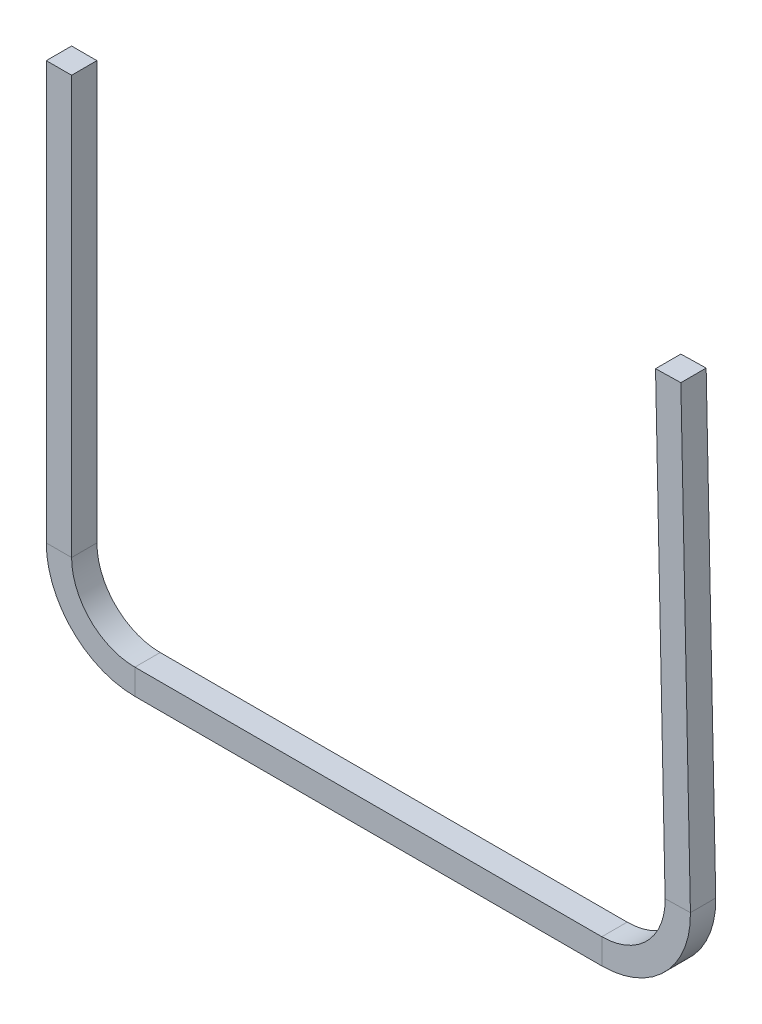
ISO-10303-21;
HEADER;
FILE_DESCRIPTION(('STEP AP214'),'2;1');
FILE_NAME('part.step','',(''),(''),'','','');
FILE_SCHEMA(('AUTOMOTIVE_DESIGN { 1 0 10303 214 1 1 1 1 }'));
ENDSEC;
DATA;
#1=APPLICATION_CONTEXT('core data for automotive mechanical design processes');
#2=APPLICATION_PROTOCOL_DEFINITION('international standard','automotive_design',2000,#1);
#3=PRODUCT_CONTEXT('',#1,'mechanical');
#4=PRODUCT('Part','Part','',(#3));
#5=PRODUCT_RELATED_PRODUCT_CATEGORY('part','',(#4));
#6=PRODUCT_DEFINITION_FORMATION('','',#4);
#7=PRODUCT_DEFINITION_CONTEXT('part definition',#1,'design');
#8=PRODUCT_DEFINITION('design','',#6,#7);
#9=PRODUCT_DEFINITION_SHAPE('','',#8);
#10=(LENGTH_UNIT() NAMED_UNIT(*) SI_UNIT(.MILLI.,.METRE.));
#11=(NAMED_UNIT(*) PLANE_ANGLE_UNIT() SI_UNIT($,.RADIAN.));
#12=(NAMED_UNIT(*) SI_UNIT($,.STERADIAN.) SOLID_ANGLE_UNIT());
#13=UNCERTAINTY_MEASURE_WITH_UNIT(LENGTH_MEASURE(1.E-05),#10,'distance_accuracy_value','');
#14=(GEOMETRIC_REPRESENTATION_CONTEXT(3) GLOBAL_UNCERTAINTY_ASSIGNED_CONTEXT((#13)) GLOBAL_UNIT_ASSIGNED_CONTEXT((#10,
#11,#12)) REPRESENTATION_CONTEXT('',''));
#15=CARTESIAN_POINT('',(0.,0.,0.));
#16=DIRECTION('',(0.,0.,1.));
#17=DIRECTION('',(1.,0.,0.));
#18=AXIS2_PLACEMENT_3D('',#15,#16,#17);
#19=CARTESIAN_POINT('',(25.,-190.,10.));
#20=DIRECTION('',(0.,0.,1.));
#21=DIRECTION('',(1.,0.,0.));
#22=AXIS2_PLACEMENT_3D('',#19,#20,#21);
#23=PLANE('',#22);
#24=DIRECTION('',(0.,-1.,0.));
#25=VECTOR('',#24,1.);
#26=CARTESIAN_POINT('',(25.,-190.,10.));
#27=LINE('',#26,#25);
#28=CARTESIAN_POINT('',(25.,-190.,10.));
#29=VERTEX_POINT('',#28);
#30=CARTESIAN_POINT('',(25.,-200.,10.));
#31=VERTEX_POINT('',#30);
#32=EDGE_CURVE('E11',#29,#31,#27,.T.);
#33=ORIENTED_EDGE('',*,*,#32,.F.);
#34=CARTESIAN_POINT('',(25.,-165.,10.));
#35=DIRECTION('',(0.,0.,-1.));
#36=DIRECTION('',(-1.,0.,0.));
#37=AXIS2_PLACEMENT_3D('',#34,#35,#36);
#38=CIRCLE('',#37,25.);
#39=CARTESIAN_POINT('',(0.,-165.,10.));
#40=VERTEX_POINT('',#39);
#41=EDGE_CURVE('E249',#40,#29,#38,.F.);
#42=ORIENTED_EDGE('',*,*,#41,.F.);
#43=DIRECTION('',(1.,0.,0.));
#44=VECTOR('',#43,1.);
#45=CARTESIAN_POINT('',(-10.,-165.,10.));
#46=LINE('',#45,#44);
#47=CARTESIAN_POINT('',(-10.,-165.,10.));
#48=VERTEX_POINT('',#47);
#49=EDGE_CURVE('E47',#48,#40,#46,.T.);
#50=ORIENTED_EDGE('',*,*,#49,.F.);
#51=CARTESIAN_POINT('',(25.,-165.,10.));
#52=DIRECTION('',(0.,0.,1.));
#53=DIRECTION('',(1.,0.,0.));
#54=AXIS2_PLACEMENT_3D('',#51,#52,#53);
#55=CIRCLE('',#54,35.);
#56=EDGE_CURVE('E148',#48,#31,#55,.T.);
#57=ORIENTED_EDGE('',*,*,#56,.T.);
#58=EDGE_LOOP('',(#33,#42,#50,#57));
#59=FACE_BOUND('',#58,.T.);
#60=ADVANCED_FACE('F39',(#59),#23,.T.);
#61=CARTESIAN_POINT('',(-10.,-165.,10.));
#62=DIRECTION('',(0.,0.,1.));
#63=DIRECTION('',(1.,0.,0.));
#64=AXIS2_PLACEMENT_3D('',#61,#62,#63);
#65=PLANE('',#64);
#66=DIRECTION('',(1.,0.,0.));
#67=VECTOR('',#66,1.);
#68=CARTESIAN_POINT('',(0.,-190.,10.));
#69=LINE('',#68,#67);
#70=CARTESIAN_POINT('',(209.468144658054,-190.,10.));
#71=VERTEX_POINT('',#70);
#72=EDGE_CURVE('E142',#29,#71,#69,.T.);
#73=ORIENTED_EDGE('',*,*,#72,.F.);
#74=ORIENTED_EDGE('',*,*,#32,.T.);
#75=DIRECTION('',(1.,0.,0.));
#76=VECTOR('',#75,1.);
#77=CARTESIAN_POINT('',(0.,-200.,10.));
#78=LINE('',#77,#76);
#79=CARTESIAN_POINT('',(209.468144658054,-200.,10.));
#80=VERTEX_POINT('',#79);
#81=EDGE_CURVE('E139',#31,#80,#78,.T.);
#82=ORIENTED_EDGE('',*,*,#81,.T.);
#83=DIRECTION('',(0.,1.,0.));
#84=VECTOR('',#83,1.);
#85=CARTESIAN_POINT('',(209.468144658054,-200.,10.));
#86=LINE('',#85,#84);
#87=EDGE_CURVE('E230',#80,#71,#86,.T.);
#88=ORIENTED_EDGE('',*,*,#87,.T.);
#89=EDGE_LOOP('',(#73,#74,#82,#88));
#90=FACE_BOUND('',#89,.T.);
#91=ADVANCED_FACE('F137',(#90),#65,.T.);
#92=CARTESIAN_POINT('',(0.,-165.,0.));
#93=DIRECTION('',(0.,0.,-1.));
#94=DIRECTION('',(-1.,0.,0.));
#95=AXIS2_PLACEMENT_3D('',#92,#93,#94);
#96=PLANE('',#95);
#97=DIRECTION('',(-1.,0.,0.));
#98=VECTOR('',#97,1.);
#99=CARTESIAN_POINT('',(0.,-165.,0.));
#100=LINE('',#99,#98);
#101=CARTESIAN_POINT('',(0.,-165.,0.));
#102=VERTEX_POINT('',#101);
#103=CARTESIAN_POINT('',(-10.,-165.,0.));
#104=VERTEX_POINT('',#103);
#105=EDGE_CURVE('E235',#102,#104,#100,.T.);
#106=ORIENTED_EDGE('',*,*,#105,.F.);
#107=CARTESIAN_POINT('',(25.,-165.,0.));
#108=DIRECTION('',(0.,0.,-1.));
#109=DIRECTION('',(-1.,0.,0.));
#110=AXIS2_PLACEMENT_3D('',#107,#108,#109);
#111=CIRCLE('',#110,25.);
#112=CARTESIAN_POINT('',(25.,-190.,0.));
#113=VERTEX_POINT('',#112);
#114=EDGE_CURVE('E187',#102,#113,#111,.F.);
#115=ORIENTED_EDGE('',*,*,#114,.T.);
#116=DIRECTION('',(0.,1.,0.));
#117=VECTOR('',#116,1.);
#118=CARTESIAN_POINT('',(25.,-200.,0.));
#119=LINE('',#118,#117);
#120=CARTESIAN_POINT('',(25.,-200.,0.));
#121=VERTEX_POINT('',#120);
#122=EDGE_CURVE('E233',#121,#113,#119,.T.);
#123=ORIENTED_EDGE('',*,*,#122,.F.);
#124=CARTESIAN_POINT('',(25.,-165.,0.));
#125=DIRECTION('',(0.,0.,1.));
#126=DIRECTION('',(1.,0.,0.));
#127=AXIS2_PLACEMENT_3D('',#124,#125,#126);
#128=CIRCLE('',#127,35.);
#129=EDGE_CURVE('E160',#104,#121,#128,.T.);
#130=ORIENTED_EDGE('',*,*,#129,.F.);
#131=EDGE_LOOP('',(#106,#115,#123,#130));
#132=FACE_BOUND('',#131,.T.);
#133=ADVANCED_FACE('F287',(#132),#96,.T.);
#134=CARTESIAN_POINT('',(25.,-200.,0.));
#135=DIRECTION('',(0.,0.,-1.));
#136=DIRECTION('',(-1.,0.,0.));
#137=AXIS2_PLACEMENT_3D('',#134,#135,#136);
#138=PLANE('',#137);
#139=DIRECTION('',(0.,-1.,0.));
#140=VECTOR('',#139,1.);
#141=CARTESIAN_POINT('',(0.,0.,0.));
#142=LINE('',#141,#140);
#143=CARTESIAN_POINT('',(0.,0.,0.));
#144=VERTEX_POINT('',#143);
#145=EDGE_CURVE('E190',#144,#102,#142,.T.);
#146=ORIENTED_EDGE('',*,*,#145,.T.);
#147=ORIENTED_EDGE('',*,*,#105,.T.);
#148=DIRECTION('',(0.,1.,0.));
#149=VECTOR('',#148,1.);
#150=CARTESIAN_POINT('',(-10.,0.,0.));
#151=LINE('',#150,#149);
#152=CARTESIAN_POINT('',(-10.,0.,0.));
#153=VERTEX_POINT('',#152);
#154=EDGE_CURVE('E196',#153,#104,#151,.F.);
#155=ORIENTED_EDGE('',*,*,#154,.F.);
#156=DIRECTION('',(1.,0.,0.));
#157=VECTOR('',#156,1.);
#158=CARTESIAN_POINT('',(-10.,0.,0.));
#159=LINE('',#158,#157);
#160=EDGE_CURVE('E193',#153,#144,#159,.T.);
#161=ORIENTED_EDGE('',*,*,#160,.T.);
#162=EDGE_LOOP('',(#146,#147,#155,#161));
#163=FACE_BOUND('',#162,.T.);
#164=ADVANCED_FACE('F290',(#163),#138,.T.);
#165=CARTESIAN_POINT('',(234.462606332776,-164.473800806848,10.));
#166=DIRECTION('',(0.,0.,1.));
#167=DIRECTION('',(1.,0.,0.));
#168=AXIS2_PLACEMENT_3D('',#165,#166,#167);
#169=PLANE('',#168);
#170=DIRECTION('',(0.999778466988863,0.0210479677260817,0.));
#171=VECTOR('',#170,1.);
#172=CARTESIAN_POINT('',(234.462606332776,-164.473800806848,10.));
#173=LINE('',#172,#171);
#174=CARTESIAN_POINT('',(234.462606332776,-164.473800806848,10.));
#175=VERTEX_POINT('',#174);
#176=CARTESIAN_POINT('',(244.460391002664,-164.263321129587,10.));
#177=VERTEX_POINT('',#176);
#178=EDGE_CURVE('E55',#175,#177,#173,.T.);
#179=ORIENTED_EDGE('',*,*,#178,.F.);
#180=CARTESIAN_POINT('',(209.468144658054,-165.,10.));
#181=DIRECTION('',(0.,0.,-1.));
#182=DIRECTION('',(-1.,0.,0.));
#183=AXIS2_PLACEMENT_3D('',#180,#181,#182);
#184=CIRCLE('',#183,25.);
#185=EDGE_CURVE('E259',#71,#175,#184,.F.);
#186=ORIENTED_EDGE('',*,*,#185,.F.);
#187=ORIENTED_EDGE('',*,*,#87,.F.);
#188=CARTESIAN_POINT('',(209.468144658054,-165.,10.));
#189=DIRECTION('',(0.,0.,1.));
#190=DIRECTION('',(1.,0.,0.));
#191=AXIS2_PLACEMENT_3D('',#188,#189,#190);
#192=CIRCLE('',#191,35.);
#193=EDGE_CURVE('E168',#80,#177,#192,.T.);
#194=ORIENTED_EDGE('',*,*,#193,.T.);
#195=EDGE_LOOP('',(#179,#186,#187,#194));
#196=FACE_BOUND('',#195,.T.);
#197=ADVANCED_FACE('F282',(#196),#169,.T.);
#198=CARTESIAN_POINT('',(209.468144658054,-200.,10.));
#199=DIRECTION('',(0.,0.,1.));
#200=DIRECTION('',(1.,0.,0.));
#201=AXIS2_PLACEMENT_3D('',#198,#199,#200);
#202=PLANE('',#201);
#203=DIRECTION('',(-0.021047967726081,0.999778466988863,0.));
#204=VECTOR('',#203,1.);
#205=CARTESIAN_POINT('',(235.,-190.,10.));
#206=LINE('',#205,#204);
#207=CARTESIAN_POINT('',(230.685166616153,14.954585732717,10.));
#208=VERTEX_POINT('',#207);
#209=EDGE_CURVE('E262',#175,#208,#206,.T.);
#210=ORIENTED_EDGE('',*,*,#209,.F.);
#211=ORIENTED_EDGE('',*,*,#178,.T.);
#212=DIRECTION('',(-0.021047967726081,0.999778466988864,0.));
#213=VECTOR('',#212,1.);
#214=CARTESIAN_POINT('',(244.997784669889,-189.789520322739,10.));
#215=LINE('',#214,#213);
#216=CARTESIAN_POINT('',(240.682951286042,15.1650654099779,10.));
#217=VERTEX_POINT('',#216);
#218=EDGE_CURVE('E109',#177,#217,#215,.T.);
#219=ORIENTED_EDGE('',*,*,#218,.T.);
#220=DIRECTION('',(0.999778466988863,0.0210479677260872,0.));
#221=VECTOR('',#220,1.);
#222=CARTESIAN_POINT('',(230.685166616153,14.954585732717,10.));
#223=LINE('',#222,#221);
#224=EDGE_CURVE('E265',#208,#217,#223,.T.);
#225=ORIENTED_EDGE('',*,*,#224,.F.);
#226=EDGE_LOOP('',(#210,#211,#219,#225));
#227=FACE_BOUND('',#226,.T.);
#228=ADVANCED_FACE('F271',(#227),#202,.T.);
#229=CARTESIAN_POINT('',(209.468144658054,-190.,0.));
#230=DIRECTION('',(0.,0.,-1.));
#231=DIRECTION('',(-1.,0.,0.));
#232=AXIS2_PLACEMENT_3D('',#229,#230,#231);
#233=PLANE('',#232);
#234=DIRECTION('',(0.,-1.,0.));
#235=VECTOR('',#234,1.);
#236=CARTESIAN_POINT('',(209.468144658054,-190.,0.));
#237=LINE('',#236,#235);
#238=CARTESIAN_POINT('',(209.468144658054,-190.,0.));
#239=VERTEX_POINT('',#238);
#240=CARTESIAN_POINT('',(209.468144658054,-200.,0.));
#241=VERTEX_POINT('',#240);
#242=EDGE_CURVE('E96',#239,#241,#237,.T.);
#243=ORIENTED_EDGE('',*,*,#242,.F.);
#244=CARTESIAN_POINT('',(209.468144658054,-165.,0.));
#245=DIRECTION('',(0.,0.,-1.));
#246=DIRECTION('',(-1.,0.,0.));
#247=AXIS2_PLACEMENT_3D('',#244,#245,#246);
#248=CIRCLE('',#247,25.);
#249=CARTESIAN_POINT('',(234.462606332776,-164.473800806848,0.));
#250=VERTEX_POINT('',#249);
#251=EDGE_CURVE('E183',#239,#250,#248,.F.);
#252=ORIENTED_EDGE('',*,*,#251,.T.);
#253=DIRECTION('',(-0.999778466988863,-0.0210479677260817,0.));
#254=VECTOR('',#253,1.);
#255=CARTESIAN_POINT('',(244.460391002664,-164.263321129587,0.));
#256=LINE('',#255,#254);
#257=CARTESIAN_POINT('',(244.460391002664,-164.263321129587,0.));
#258=VERTEX_POINT('',#257);
#259=EDGE_CURVE('E103',#258,#250,#256,.T.);
#260=ORIENTED_EDGE('',*,*,#259,.F.);
#261=CARTESIAN_POINT('',(209.468144658054,-165.,0.));
#262=DIRECTION('',(0.,0.,1.));
#263=DIRECTION('',(1.,0.,0.));
#264=AXIS2_PLACEMENT_3D('',#261,#262,#263);
#265=CIRCLE('',#264,35.);
#266=EDGE_CURVE('E202',#241,#258,#265,.T.);
#267=ORIENTED_EDGE('',*,*,#266,.F.);
#268=EDGE_LOOP('',(#243,#252,#260,#267));
#269=FACE_BOUND('',#268,.T.);
#270=ADVANCED_FACE('F319',(#269),#233,.T.);
#271=CARTESIAN_POINT('',(244.460391002664,-164.263321129587,0.));
#272=DIRECTION('',(0.,0.,-1.));
#273=DIRECTION('',(-1.,0.,0.));
#274=AXIS2_PLACEMENT_3D('',#271,#272,#273);
#275=PLANE('',#274);
#276=DIRECTION('',(1.,0.,0.));
#277=VECTOR('',#276,1.);
#278=CARTESIAN_POINT('',(0.,-190.,0.));
#279=LINE('',#278,#277);
#280=EDGE_CURVE('E185',#113,#239,#279,.T.);
#281=ORIENTED_EDGE('',*,*,#280,.T.);
#282=ORIENTED_EDGE('',*,*,#242,.T.);
#283=DIRECTION('',(1.,0.,0.));
#284=VECTOR('',#283,1.);
#285=CARTESIAN_POINT('',(0.,-200.,0.));
#286=LINE('',#285,#284);
#287=EDGE_CURVE('E200',#121,#241,#286,.T.);
#288=ORIENTED_EDGE('',*,*,#287,.F.);
#289=ORIENTED_EDGE('',*,*,#122,.T.);
#290=EDGE_LOOP('',(#281,#282,#288,#289));
#291=FACE_BOUND('',#290,.T.);
#292=ADVANCED_FACE('F322',(#291),#275,.T.);
#293=CARTESIAN_POINT('',(244.997784669889,-189.789520322739,10.));
#294=DIRECTION('',(-0.999778466988864,-0.021047967726081,0.));
#295=DIRECTION('',(0.021047967726081,-0.999778466988864,0.));
#296=AXIS2_PLACEMENT_3D('',#293,#294,#295);
#297=PLANE('',#296);
#298=DIRECTION('',(-0.021047967726081,0.999778466988864,0.));
#299=VECTOR('',#298,1.);
#300=CARTESIAN_POINT('',(244.997784669889,-189.789520322739,0.));
#301=LINE('',#300,#299);
#302=CARTESIAN_POINT('',(240.682951286042,15.1650654099779,0.));
#303=VERTEX_POINT('',#302);
#304=EDGE_CURVE('E174',#258,#303,#301,.T.);
#305=ORIENTED_EDGE('',*,*,#304,.T.);
#306=DIRECTION('',(0.,0.,-1.));
#307=VECTOR('',#306,1.);
#308=CARTESIAN_POINT('',(240.682951286042,15.1650654099779,10.));
#309=LINE('',#308,#307);
#310=EDGE_CURVE('E226',#217,#303,#309,.T.);
#311=ORIENTED_EDGE('',*,*,#310,.F.);
#312=ORIENTED_EDGE('',*,*,#218,.F.);
#313=DIRECTION('',(0.,0.,-1.));
#314=VECTOR('',#313,1.);
#315=CARTESIAN_POINT('',(244.460391002664,-164.263321129587,10.));
#316=LINE('',#315,#314);
#317=EDGE_CURVE('E170',#177,#258,#316,.T.);
#318=ORIENTED_EDGE('',*,*,#317,.T.);
#319=EDGE_LOOP('',(#305,#311,#312,#318));
#320=FACE_BOUND('',#319,.T.);
#321=ADVANCED_FACE('F325',(#320),#297,.F.);
#322=CARTESIAN_POINT('',(230.685166616153,14.954585732717,10.));
#323=DIRECTION('',(-0.0210479677260872,0.999778466988863,0.));
#324=DIRECTION('',(-0.999778466988863,-0.0210479677260872,0.));
#325=AXIS2_PLACEMENT_3D('',#322,#323,#324);
#326=PLANE('',#325);
#327=DIRECTION('',(0.999778466988863,0.0210479677260872,0.));
#328=VECTOR('',#327,1.);
#329=CARTESIAN_POINT('',(230.685166616153,14.954585732717,0.));
#330=LINE('',#329,#328);
#331=CARTESIAN_POINT('',(230.685166616153,14.954585732717,0.));
#332=VERTEX_POINT('',#331);
#333=EDGE_CURVE('E177',#332,#303,#330,.T.);
#334=ORIENTED_EDGE('',*,*,#333,.F.);
#335=DIRECTION('',(0.,0.,-1.));
#336=VECTOR('',#335,1.);
#337=CARTESIAN_POINT('',(230.685166616153,14.954585732717,10.));
#338=LINE('',#337,#336);
#339=EDGE_CURVE('E224',#208,#332,#338,.T.);
#340=ORIENTED_EDGE('',*,*,#339,.F.);
#341=ORIENTED_EDGE('',*,*,#224,.T.);
#342=ORIENTED_EDGE('',*,*,#310,.T.);
#343=EDGE_LOOP('',(#334,#340,#341,#342));
#344=FACE_BOUND('',#343,.T.);
#345=ADVANCED_FACE('F270',(#344),#326,.T.);
#346=CARTESIAN_POINT('',(235.,-190.,10.));
#347=DIRECTION('',(-0.999778466988864,-0.021047967726081,0.));
#348=DIRECTION('',(0.021047967726081,-0.999778466988864,0.));
#349=AXIS2_PLACEMENT_3D('',#346,#347,#348);
#350=PLANE('',#349);
#351=DIRECTION('',(-0.021047967726081,0.999778466988863,0.));
#352=VECTOR('',#351,1.);
#353=CARTESIAN_POINT('',(235.,-190.,0.));
#354=LINE('',#353,#352);
#355=EDGE_CURVE('E180',#250,#332,#354,.T.);
#356=ORIENTED_EDGE('',*,*,#355,.F.);
#357=DIRECTION('',(0.,0.,-1.));
#358=VECTOR('',#357,1.);
#359=CARTESIAN_POINT('',(234.462606332776,-164.473800806848,10.));
#360=LINE('',#359,#358);
#361=EDGE_CURVE('E221',#175,#250,#360,.T.);
#362=ORIENTED_EDGE('',*,*,#361,.F.);
#363=ORIENTED_EDGE('',*,*,#209,.T.);
#364=ORIENTED_EDGE('',*,*,#339,.T.);
#365=EDGE_LOOP('',(#356,#362,#363,#364));
#366=FACE_BOUND('',#365,.T.);
#367=ADVANCED_FACE('F275',(#366),#350,.T.);
#368=CARTESIAN_POINT('',(209.468144658054,-165.,10.));
#369=DIRECTION('',(0.,0.,-1.));
#370=DIRECTION('',(-1.,0.,0.));
#371=AXIS2_PLACEMENT_3D('',#368,#369,#370);
#372=CYLINDRICAL_SURFACE('',#371,25.);
#373=ORIENTED_EDGE('',*,*,#251,.F.);
#374=DIRECTION('',(0.,0.,-1.));
#375=VECTOR('',#374,1.);
#376=CARTESIAN_POINT('',(209.468144658054,-190.,10.));
#377=LINE('',#376,#375);
#378=EDGE_CURVE('E218',#71,#239,#377,.T.);
#379=ORIENTED_EDGE('',*,*,#378,.F.);
#380=ORIENTED_EDGE('',*,*,#185,.T.);
#381=ORIENTED_EDGE('',*,*,#361,.T.);
#382=EDGE_LOOP('',(#373,#379,#380,#381));
#383=FACE_BOUND('',#382,.T.);
#384=ADVANCED_FACE('F278',(#383),#372,.F.);
#385=CARTESIAN_POINT('',(0.,-190.,10.));
#386=DIRECTION('',(0.,1.,0.));
#387=DIRECTION('',(0.,0.,1.));
#388=AXIS2_PLACEMENT_3D('',#385,#386,#387);
#389=PLANE('',#388);
#390=ORIENTED_EDGE('',*,*,#280,.F.);
#391=DIRECTION('',(0.,0.,-1.));
#392=VECTOR('',#391,1.);
#393=CARTESIAN_POINT('',(25.,-190.,10.));
#394=LINE('',#393,#392);
#395=EDGE_CURVE('E215',#29,#113,#394,.T.);
#396=ORIENTED_EDGE('',*,*,#395,.F.);
#397=ORIENTED_EDGE('',*,*,#72,.T.);
#398=ORIENTED_EDGE('',*,*,#378,.T.);
#399=EDGE_LOOP('',(#390,#396,#397,#398));
#400=FACE_BOUND('',#399,.T.);
#401=ADVANCED_FACE('F285',(#400),#389,.T.);
#402=CARTESIAN_POINT('',(25.,-165.,10.));
#403=DIRECTION('',(0.,0.,-1.));
#404=DIRECTION('',(-1.,0.,0.));
#405=AXIS2_PLACEMENT_3D('',#402,#403,#404);
#406=CYLINDRICAL_SURFACE('',#405,25.);
#407=ORIENTED_EDGE('',*,*,#114,.F.);
#408=DIRECTION('',(0.,0.,-1.));
#409=VECTOR('',#408,1.);
#410=CARTESIAN_POINT('',(0.,-165.,10.));
#411=LINE('',#410,#409);
#412=EDGE_CURVE('E212',#40,#102,#411,.T.);
#413=ORIENTED_EDGE('',*,*,#412,.F.);
#414=ORIENTED_EDGE('',*,*,#41,.T.);
#415=ORIENTED_EDGE('',*,*,#395,.T.);
#416=EDGE_LOOP('',(#407,#413,#414,#415));
#417=FACE_BOUND('',#416,.T.);
#418=ADVANCED_FACE('F248',(#417),#406,.F.);
#419=CARTESIAN_POINT('',(0.,0.,10.));
#420=DIRECTION('',(1.,0.,0.));
#421=DIRECTION('',(0.,0.,-1.));
#422=AXIS2_PLACEMENT_3D('',#419,#420,#421);
#423=PLANE('',#422);
#424=ORIENTED_EDGE('',*,*,#145,.F.);
#425=DIRECTION('',(0.,0.,-1.));
#426=VECTOR('',#425,1.);
#427=CARTESIAN_POINT('',(0.,0.,10.));
#428=LINE('',#427,#426);
#429=CARTESIAN_POINT('',(0.,0.,10.));
#430=VERTEX_POINT('',#429);
#431=EDGE_CURVE('E210',#430,#144,#428,.T.);
#432=ORIENTED_EDGE('',*,*,#431,.F.);
#433=DIRECTION('',(0.,-1.,0.));
#434=VECTOR('',#433,1.);
#435=CARTESIAN_POINT('',(0.,0.,10.));
#436=LINE('',#435,#434);
#437=EDGE_CURVE('E242',#430,#40,#436,.T.);
#438=ORIENTED_EDGE('',*,*,#437,.T.);
#439=ORIENTED_EDGE('',*,*,#412,.T.);
#440=EDGE_LOOP('',(#424,#432,#438,#439));
#441=FACE_BOUND('',#440,.T.);
#442=ADVANCED_FACE('F253',(#441),#423,.T.);
#443=CARTESIAN_POINT('',(-10.,0.,10.));
#444=DIRECTION('',(0.,1.,0.));
#445=DIRECTION('',(0.,0.,1.));
#446=AXIS2_PLACEMENT_3D('',#443,#444,#445);
#447=PLANE('',#446);
#448=ORIENTED_EDGE('',*,*,#160,.F.);
#449=DIRECTION('',(0.,0.,-1.));
#450=VECTOR('',#449,1.);
#451=CARTESIAN_POINT('',(-10.,0.,10.));
#452=LINE('',#451,#450);
#453=CARTESIAN_POINT('',(-10.,0.,10.));
#454=VERTEX_POINT('',#453);
#455=EDGE_CURVE('E208',#454,#153,#452,.T.);
#456=ORIENTED_EDGE('',*,*,#455,.F.);
#457=DIRECTION('',(1.,0.,0.));
#458=VECTOR('',#457,1.);
#459=CARTESIAN_POINT('',(-10.,0.,10.));
#460=LINE('',#459,#458);
#461=EDGE_CURVE('E254',#454,#430,#460,.T.);
#462=ORIENTED_EDGE('',*,*,#461,.T.);
#463=ORIENTED_EDGE('',*,*,#431,.T.);
#464=EDGE_LOOP('',(#448,#456,#462,#463));
#465=FACE_BOUND('',#464,.T.);
#466=ADVANCED_FACE('F295',(#465),#447,.T.);
#467=CARTESIAN_POINT('',(-10.,0.,10.));
#468=DIRECTION('',(1.,0.,0.));
#469=DIRECTION('',(0.,0.,-1.));
#470=AXIS2_PLACEMENT_3D('',#467,#468,#469);
#471=PLANE('',#470);
#472=ORIENTED_EDGE('',*,*,#154,.T.);
#473=DIRECTION('',(0.,0.,-1.));
#474=VECTOR('',#473,1.);
#475=CARTESIAN_POINT('',(-10.,-165.,10.));
#476=LINE('',#475,#474);
#477=EDGE_CURVE('E162',#48,#104,#476,.T.);
#478=ORIENTED_EDGE('',*,*,#477,.F.);
#479=DIRECTION('',(0.,1.,0.));
#480=VECTOR('',#479,1.);
#481=CARTESIAN_POINT('',(-10.,0.,10.));
#482=LINE('',#481,#480);
#483=EDGE_CURVE('E153',#454,#48,#482,.F.);
#484=ORIENTED_EDGE('',*,*,#483,.F.);
#485=ORIENTED_EDGE('',*,*,#455,.T.);
#486=EDGE_LOOP('',(#472,#478,#484,#485));
#487=FACE_BOUND('',#486,.T.);
#488=ADVANCED_FACE('F293',(#487),#471,.F.);
#489=CARTESIAN_POINT('',(25.,-165.,10.));
#490=DIRECTION('',(0.,0.,-1.));
#491=DIRECTION('',(-1.,0.,0.));
#492=AXIS2_PLACEMENT_3D('',#489,#490,#491);
#493=CYLINDRICAL_SURFACE('',#492,35.);
#494=ORIENTED_EDGE('',*,*,#129,.T.);
#495=DIRECTION('',(0.,0.,-1.));
#496=VECTOR('',#495,1.);
#497=CARTESIAN_POINT('',(25.,-200.,10.));
#498=LINE('',#497,#496);
#499=EDGE_CURVE('E157',#31,#121,#498,.T.);
#500=ORIENTED_EDGE('',*,*,#499,.F.);
#501=ORIENTED_EDGE('',*,*,#56,.F.);
#502=ORIENTED_EDGE('',*,*,#477,.T.);
#503=EDGE_LOOP('',(#494,#500,#501,#502));
#504=FACE_BOUND('',#503,.T.);
#505=ADVANCED_FACE('F158',(#504),#493,.T.);
#506=CARTESIAN_POINT('',(0.,-200.,10.));
#507=DIRECTION('',(0.,1.,0.));
#508=DIRECTION('',(0.,0.,1.));
#509=AXIS2_PLACEMENT_3D('',#506,#507,#508);
#510=PLANE('',#509);
#511=ORIENTED_EDGE('',*,*,#287,.T.);
#512=DIRECTION('',(0.,0.,-1.));
#513=VECTOR('',#512,1.);
#514=CARTESIAN_POINT('',(209.468144658054,-200.,10.));
#515=LINE('',#514,#513);
#516=EDGE_CURVE('E163',#80,#241,#515,.T.);
#517=ORIENTED_EDGE('',*,*,#516,.F.);
#518=ORIENTED_EDGE('',*,*,#81,.F.);
#519=ORIENTED_EDGE('',*,*,#499,.T.);
#520=EDGE_LOOP('',(#511,#517,#518,#519));
#521=FACE_BOUND('',#520,.T.);
#522=ADVANCED_FACE('F165',(#521),#510,.F.);
#523=CARTESIAN_POINT('',(209.468144658054,-165.,10.));
#524=DIRECTION('',(0.,0.,-1.));
#525=DIRECTION('',(-1.,0.,0.));
#526=AXIS2_PLACEMENT_3D('',#523,#524,#525);
#527=CYLINDRICAL_SURFACE('',#526,35.);
#528=ORIENTED_EDGE('',*,*,#266,.T.);
#529=ORIENTED_EDGE('',*,*,#317,.F.);
#530=ORIENTED_EDGE('',*,*,#193,.F.);
#531=ORIENTED_EDGE('',*,*,#516,.T.);
#532=EDGE_LOOP('',(#528,#529,#530,#531));
#533=FACE_BOUND('',#532,.T.);
#534=ADVANCED_FACE('F377',(#533),#527,.T.);
#535=CARTESIAN_POINT('',(209.468144658054,-165.,10.));
#536=DIRECTION('',(0.,0.,-1.));
#537=DIRECTION('',(-1.,0.,0.));
#538=AXIS2_PLACEMENT_3D('',#535,#536,#537);
#539=PLANE('',#538);
#540=ORIENTED_EDGE('',*,*,#483,.T.);
#541=ORIENTED_EDGE('',*,*,#49,.T.);
#542=ORIENTED_EDGE('',*,*,#437,.F.);
#543=ORIENTED_EDGE('',*,*,#461,.F.);
#544=EDGE_LOOP('',(#540,#541,#542,#543));
#545=FACE_BOUND('',#544,.T.);
#546=ADVANCED_FACE('F239',(#545),#539,.F.);
#547=CARTESIAN_POINT('',(209.468144658054,-165.,0.));
#548=DIRECTION('',(0.,0.,-1.));
#549=DIRECTION('',(-1.,0.,0.));
#550=AXIS2_PLACEMENT_3D('',#547,#548,#549);
#551=PLANE('',#550);
#552=ORIENTED_EDGE('',*,*,#304,.F.);
#553=ORIENTED_EDGE('',*,*,#259,.T.);
#554=ORIENTED_EDGE('',*,*,#355,.T.);
#555=ORIENTED_EDGE('',*,*,#333,.T.);
#556=EDGE_LOOP('',(#552,#553,#554,#555));
#557=FACE_BOUND('',#556,.T.);
#558=ADVANCED_FACE('F397',(#557),#551,.T.);
#559=CLOSED_SHELL('',(#60,#91,#133,#164,#197,#228,#270,#292,#321,#345,#367,#384,#401,#418,#442,
#466,#488,#505,#522,#534,#546,#558));
#560=MANIFOLD_SOLID_BREP('B2',#559);
#561=ADVANCED_BREP_SHAPE_REPRESENTATION('',(#18,#560),#14);
#562=SHAPE_DEFINITION_REPRESENTATION(#9,#561);
ENDSEC;
END-ISO-10303-21;
